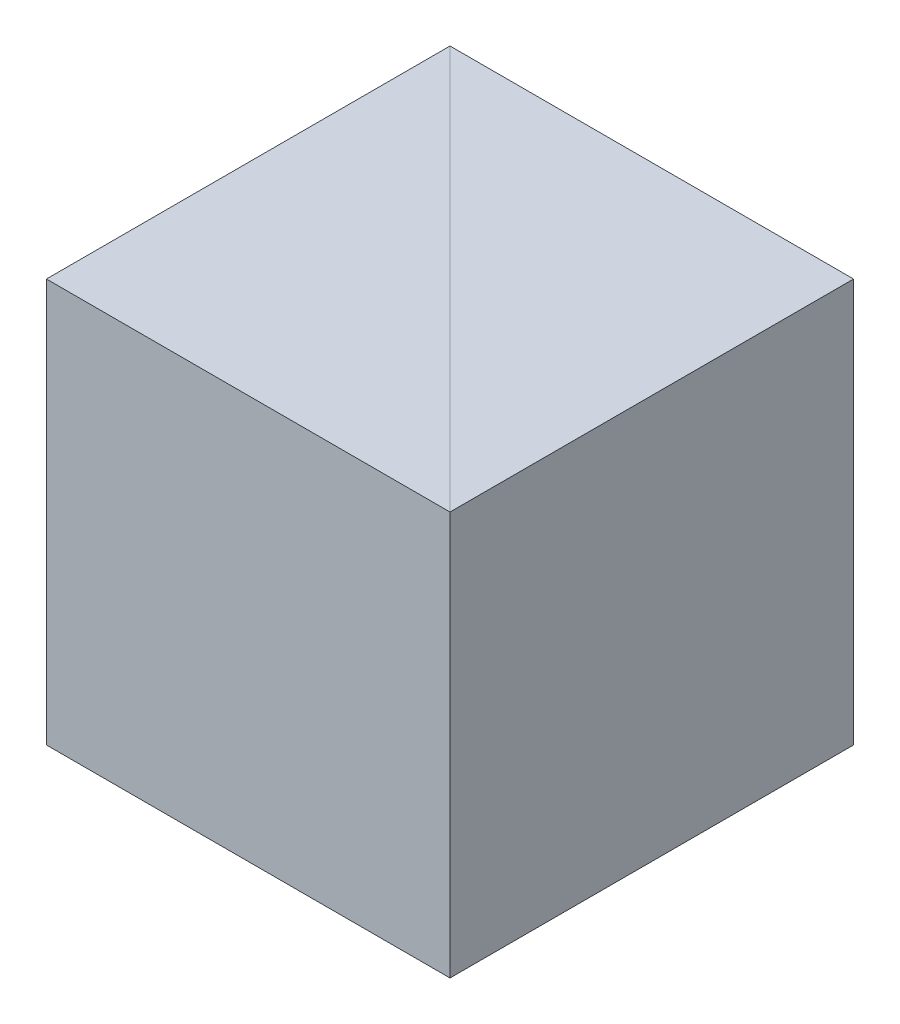
ISO-10303-21;
HEADER;
FILE_DESCRIPTION(('STEP AP214'),'2;1');
FILE_NAME('part.step','',(''),(''),'','','');
FILE_SCHEMA(('AUTOMOTIVE_DESIGN { 1 0 10303 214 1 1 1 1 }'));
ENDSEC;
DATA;
#1=APPLICATION_CONTEXT('core data for automotive mechanical design processes');
#2=APPLICATION_PROTOCOL_DEFINITION('international standard','automotive_design',2000,#1);
#3=PRODUCT_CONTEXT('',#1,'mechanical');
#4=PRODUCT('Part','Part','',(#3));
#5=PRODUCT_RELATED_PRODUCT_CATEGORY('part','',(#4));
#6=PRODUCT_DEFINITION_FORMATION('','',#4);
#7=PRODUCT_DEFINITION_CONTEXT('part definition',#1,'design');
#8=PRODUCT_DEFINITION('design','',#6,#7);
#9=PRODUCT_DEFINITION_SHAPE('','',#8);
#10=(LENGTH_UNIT() NAMED_UNIT(*) SI_UNIT(.MILLI.,.METRE.));
#11=(NAMED_UNIT(*) PLANE_ANGLE_UNIT() SI_UNIT($,.RADIAN.));
#12=(NAMED_UNIT(*) SI_UNIT($,.STERADIAN.) SOLID_ANGLE_UNIT());
#13=UNCERTAINTY_MEASURE_WITH_UNIT(LENGTH_MEASURE(1.E-05),#10,'distance_accuracy_value','');
#14=(GEOMETRIC_REPRESENTATION_CONTEXT(3) GLOBAL_UNCERTAINTY_ASSIGNED_CONTEXT((#13)) GLOBAL_UNIT_ASSIGNED_CONTEXT((#10,
#11,#12)) REPRESENTATION_CONTEXT('',''));
#15=CARTESIAN_POINT('',(0.,0.,0.));
#16=DIRECTION('',(0.,0.,1.));
#17=DIRECTION('',(1.,0.,0.));
#18=AXIS2_PLACEMENT_3D('',#15,#16,#17);
#19=CARTESIAN_POINT('',(0.,12.5,0.));
#20=DIRECTION('',(0.707106781186547,0.,-0.707106781186548));
#21=DIRECTION('',(-0.707106781186548,0.,-0.707106781186547));
#22=AXIS2_PLACEMENT_3D('',#19,#20,#21);
#23=PLANE('',#22);
#24=DIRECTION('',(0.707106781186548,0.,0.707106781186547));
#25=VECTOR('',#24,1.);
#26=CARTESIAN_POINT('',(0.,0.,0.));
#27=LINE('',#26,#25);
#28=CARTESIAN_POINT('',(-12.5,0.,-12.5));
#29=VERTEX_POINT('',#28);
#30=CARTESIAN_POINT('',(0.,0.,0.));
#31=VERTEX_POINT('',#30);
#32=EDGE_CURVE('E97',#29,#31,#27,.T.);
#33=ORIENTED_EDGE('',*,*,#32,.F.);
#34=DIRECTION('',(0.,-1.,0.));
#35=VECTOR('',#34,1.);
#36=CARTESIAN_POINT('',(-12.5,12.5,-12.5));
#37=LINE('',#36,#35);
#38=CARTESIAN_POINT('',(-12.5,12.5,-12.5));
#39=VERTEX_POINT('',#38);
#40=EDGE_CURVE('E12',#39,#29,#37,.T.);
#41=ORIENTED_EDGE('',*,*,#40,.F.);
#42=DIRECTION('',(0.707106781186548,0.,0.707106781186547));
#43=VECTOR('',#42,1.);
#44=CARTESIAN_POINT('',(0.,12.5,0.));
#45=LINE('',#44,#43);
#46=CARTESIAN_POINT('',(0.,12.5,0.));
#47=VERTEX_POINT('',#46);
#48=EDGE_CURVE('E89',#39,#47,#45,.T.);
#49=ORIENTED_EDGE('',*,*,#48,.T.);
#50=DIRECTION('',(0.,-1.,0.));
#51=VECTOR('',#50,1.);
#52=CARTESIAN_POINT('',(0.,12.5,0.));
#53=LINE('',#52,#51);
#54=EDGE_CURVE('E48',#47,#31,#53,.T.);
#55=ORIENTED_EDGE('',*,*,#54,.T.);
#56=EDGE_LOOP('',(#33,#41,#49,#55));
#57=FACE_BOUND('',#56,.T.);
#58=ADVANCED_FACE('F45',(#57),#23,.T.);
#59=CARTESIAN_POINT('',(-12.5,12.5,-12.5));
#60=DIRECTION('',(-1.,0.,0.));
#61=DIRECTION('',(0.,0.,1.));
#62=AXIS2_PLACEMENT_3D('',#59,#60,#61);
#63=PLANE('',#62);
#64=DIRECTION('',(0.,0.,-1.));
#65=VECTOR('',#64,1.);
#66=CARTESIAN_POINT('',(-12.5,0.,-12.5));
#67=LINE('',#66,#65);
#68=CARTESIAN_POINT('',(-12.5,0.,0.));
#69=VERTEX_POINT('',#68);
#70=EDGE_CURVE('E91',#69,#29,#67,.T.);
#71=ORIENTED_EDGE('',*,*,#70,.F.);
#72=DIRECTION('',(0.,-1.,0.));
#73=VECTOR('',#72,1.);
#74=CARTESIAN_POINT('',(-12.5,12.5,0.));
#75=LINE('',#74,#73);
#76=CARTESIAN_POINT('',(-12.5,12.5,0.));
#77=VERTEX_POINT('',#76);
#78=EDGE_CURVE('E54',#77,#69,#75,.T.);
#79=ORIENTED_EDGE('',*,*,#78,.F.);
#80=DIRECTION('',(0.,0.,-1.));
#81=VECTOR('',#80,1.);
#82=CARTESIAN_POINT('',(-12.5,12.5,-12.5));
#83=LINE('',#82,#81);
#84=EDGE_CURVE('E86',#77,#39,#83,.T.);
#85=ORIENTED_EDGE('',*,*,#84,.T.);
#86=ORIENTED_EDGE('',*,*,#40,.T.);
#87=EDGE_LOOP('',(#71,#79,#85,#86));
#88=FACE_BOUND('',#87,.T.);
#89=ADVANCED_FACE('F101',(#88),#63,.T.);
#90=CARTESIAN_POINT('',(-12.5,12.5,0.));
#91=DIRECTION('',(0.,0.,1.));
#92=DIRECTION('',(1.,0.,0.));
#93=AXIS2_PLACEMENT_3D('',#90,#91,#92);
#94=PLANE('',#93);
#95=DIRECTION('',(-1.,0.,0.));
#96=VECTOR('',#95,1.);
#97=CARTESIAN_POINT('',(-12.5,0.,0.));
#98=LINE('',#97,#96);
#99=EDGE_CURVE('E84',#31,#69,#98,.T.);
#100=ORIENTED_EDGE('',*,*,#99,.F.);
#101=ORIENTED_EDGE('',*,*,#54,.F.);
#102=DIRECTION('',(-1.,0.,0.));
#103=VECTOR('',#102,1.);
#104=CARTESIAN_POINT('',(-12.5,12.5,0.));
#105=LINE('',#104,#103);
#106=EDGE_CURVE('E82',#47,#77,#105,.T.);
#107=ORIENTED_EDGE('',*,*,#106,.T.);
#108=ORIENTED_EDGE('',*,*,#78,.T.);
#109=EDGE_LOOP('',(#100,#101,#107,#108));
#110=FACE_BOUND('',#109,.T.);
#111=ADVANCED_FACE('F81',(#110),#94,.T.);
#112=CARTESIAN_POINT('',(0.,12.5,0.));
#113=DIRECTION('',(0.,1.,0.));
#114=DIRECTION('',(0.,0.,1.));
#115=AXIS2_PLACEMENT_3D('',#112,#113,#114);
#116=PLANE('',#115);
#117=ORIENTED_EDGE('',*,*,#48,.F.);
#118=ORIENTED_EDGE('',*,*,#84,.F.);
#119=ORIENTED_EDGE('',*,*,#106,.F.);
#120=EDGE_LOOP('',(#117,#118,#119));
#121=FACE_BOUND('',#120,.T.);
#122=ADVANCED_FACE('F88',(#121),#116,.T.);
#123=CARTESIAN_POINT('',(0.,0.,0.));
#124=DIRECTION('',(0.,1.,0.));
#125=DIRECTION('',(0.,0.,1.));
#126=AXIS2_PLACEMENT_3D('',#123,#124,#125);
#127=PLANE('',#126);
#128=ORIENTED_EDGE('',*,*,#32,.T.);
#129=ORIENTED_EDGE('',*,*,#99,.T.);
#130=ORIENTED_EDGE('',*,*,#70,.T.);
#131=EDGE_LOOP('',(#128,#129,#130));
#132=FACE_BOUND('',#131,.T.);
#133=ADVANCED_FACE('F100',(#132),#127,.F.);
#134=CLOSED_SHELL('',(#58,#89,#111,#122,#133));
#135=MANIFOLD_SOLID_BREP('B2',#134);
#136=CARTESIAN_POINT('',(-12.5,12.5,-12.5));
#137=DIRECTION('',(0.707106781186547,0.,-0.707106781186548));
#138=DIRECTION('',(-0.707106781186548,0.,-0.707106781186547));
#139=AXIS2_PLACEMENT_3D('',#136,#137,#138);
#140=PLANE('',#139);
#141=DIRECTION('',(0.707106781186548,0.,0.707106781186547));
#142=VECTOR('',#141,1.);
#143=CARTESIAN_POINT('',(-12.5,0.,-12.5));
#144=LINE('',#143,#142);
#145=CARTESIAN_POINT('',(-12.5,0.,-12.5));
#146=VERTEX_POINT('',#145);
#147=CARTESIAN_POINT('',(0.,0.,0.));
#148=VERTEX_POINT('',#147);
#149=EDGE_CURVE('E190',#146,#148,#144,.T.);
#150=ORIENTED_EDGE('',*,*,#149,.T.);
#151=DIRECTION('',(0.,-1.,0.));
#152=VECTOR('',#151,1.);
#153=CARTESIAN_POINT('',(0.,12.5,0.));
#154=LINE('',#153,#152);
#155=CARTESIAN_POINT('',(0.,12.5,0.));
#156=VERTEX_POINT('',#155);
#157=EDGE_CURVE('E43',#156,#148,#154,.T.);
#158=ORIENTED_EDGE('',*,*,#157,.F.);
#159=DIRECTION('',(0.707106781186548,0.,0.707106781186547));
#160=VECTOR('',#159,1.);
#161=CARTESIAN_POINT('',(-12.5,12.5,-12.5));
#162=LINE('',#161,#160);
#163=CARTESIAN_POINT('',(-12.5,12.5,-12.5));
#164=VERTEX_POINT('',#163);
#165=EDGE_CURVE('E183',#164,#156,#162,.T.);
#166=ORIENTED_EDGE('',*,*,#165,.F.);
#167=DIRECTION('',(0.,-1.,0.));
#168=VECTOR('',#167,1.);
#169=CARTESIAN_POINT('',(-12.5,12.5,-12.5));
#170=LINE('',#169,#168);
#171=EDGE_CURVE('E191',#164,#146,#170,.T.);
#172=ORIENTED_EDGE('',*,*,#171,.T.);
#173=EDGE_LOOP('',(#150,#158,#166,#172));
#174=FACE_BOUND('',#173,.T.);
#175=ADVANCED_FACE('F143',(#174),#140,.F.);
#176=CARTESIAN_POINT('',(0.,12.5,0.));
#177=DIRECTION('',(-1.,0.,0.));
#178=DIRECTION('',(0.,0.,1.));
#179=AXIS2_PLACEMENT_3D('',#176,#177,#178);
#180=PLANE('',#179);
#181=DIRECTION('',(0.,0.,-1.));
#182=VECTOR('',#181,1.);
#183=CARTESIAN_POINT('',(0.,0.,0.));
#184=LINE('',#183,#182);
#185=CARTESIAN_POINT('',(0.,0.,-12.5));
#186=VERTEX_POINT('',#185);
#187=EDGE_CURVE('E171',#148,#186,#184,.T.);
#188=ORIENTED_EDGE('',*,*,#187,.T.);
#189=DIRECTION('',(0.,-1.,0.));
#190=VECTOR('',#189,1.);
#191=CARTESIAN_POINT('',(0.,12.5,-12.5));
#192=LINE('',#191,#190);
#193=CARTESIAN_POINT('',(0.,12.5,-12.5));
#194=VERTEX_POINT('',#193);
#195=EDGE_CURVE('E151',#194,#186,#192,.T.);
#196=ORIENTED_EDGE('',*,*,#195,.F.);
#197=DIRECTION('',(0.,0.,-1.));
#198=VECTOR('',#197,1.);
#199=CARTESIAN_POINT('',(0.,12.5,0.));
#200=LINE('',#199,#198);
#201=EDGE_CURVE('E179',#156,#194,#200,.T.);
#202=ORIENTED_EDGE('',*,*,#201,.F.);
#203=ORIENTED_EDGE('',*,*,#157,.T.);
#204=EDGE_LOOP('',(#188,#196,#202,#203));
#205=FACE_BOUND('',#204,.T.);
#206=ADVANCED_FACE('F180',(#205),#180,.F.);
#207=CARTESIAN_POINT('',(0.,12.5,-12.5));
#208=DIRECTION('',(0.,0.,1.));
#209=DIRECTION('',(1.,0.,0.));
#210=AXIS2_PLACEMENT_3D('',#207,#208,#209);
#211=PLANE('',#210);
#212=DIRECTION('',(-1.,0.,0.));
#213=VECTOR('',#212,1.);
#214=CARTESIAN_POINT('',(0.,0.,-12.5));
#215=LINE('',#214,#213);
#216=EDGE_CURVE('E176',#186,#146,#215,.T.);
#217=ORIENTED_EDGE('',*,*,#216,.T.);
#218=ORIENTED_EDGE('',*,*,#171,.F.);
#219=DIRECTION('',(-1.,0.,0.));
#220=VECTOR('',#219,1.);
#221=CARTESIAN_POINT('',(0.,12.5,-12.5));
#222=LINE('',#221,#220);
#223=EDGE_CURVE('E159',#194,#164,#222,.T.);
#224=ORIENTED_EDGE('',*,*,#223,.F.);
#225=ORIENTED_EDGE('',*,*,#195,.T.);
#226=EDGE_LOOP('',(#217,#218,#224,#225));
#227=FACE_BOUND('',#226,.T.);
#228=ADVANCED_FACE('F198',(#227),#211,.F.);
#229=CARTESIAN_POINT('',(0.,12.5,0.));
#230=DIRECTION('',(0.,1.,0.));
#231=DIRECTION('',(0.,0.,1.));
#232=AXIS2_PLACEMENT_3D('',#229,#230,#231);
#233=PLANE('',#232);
#234=ORIENTED_EDGE('',*,*,#165,.T.);
#235=ORIENTED_EDGE('',*,*,#201,.T.);
#236=ORIENTED_EDGE('',*,*,#223,.T.);
#237=EDGE_LOOP('',(#234,#235,#236));
#238=FACE_BOUND('',#237,.T.);
#239=ADVANCED_FACE('F186',(#238),#233,.T.);
#240=CARTESIAN_POINT('',(0.,0.,0.));
#241=DIRECTION('',(0.,1.,0.));
#242=DIRECTION('',(0.,0.,1.));
#243=AXIS2_PLACEMENT_3D('',#240,#241,#242);
#244=PLANE('',#243);
#245=ORIENTED_EDGE('',*,*,#149,.F.);
#246=ORIENTED_EDGE('',*,*,#216,.F.);
#247=ORIENTED_EDGE('',*,*,#187,.F.);
#248=EDGE_LOOP('',(#245,#246,#247));
#249=FACE_BOUND('',#248,.T.);
#250=ADVANCED_FACE('F199',(#249),#244,.F.);
#251=CLOSED_SHELL('',(#175,#206,#228,#239,#250));
#252=MANIFOLD_SOLID_BREP('B6',#251);
#253=ADVANCED_BREP_SHAPE_REPRESENTATION('',(#18,#135,#252),#14);
#254=SHAPE_DEFINITION_REPRESENTATION(#9,#253);
ENDSEC;
END-ISO-10303-21;
